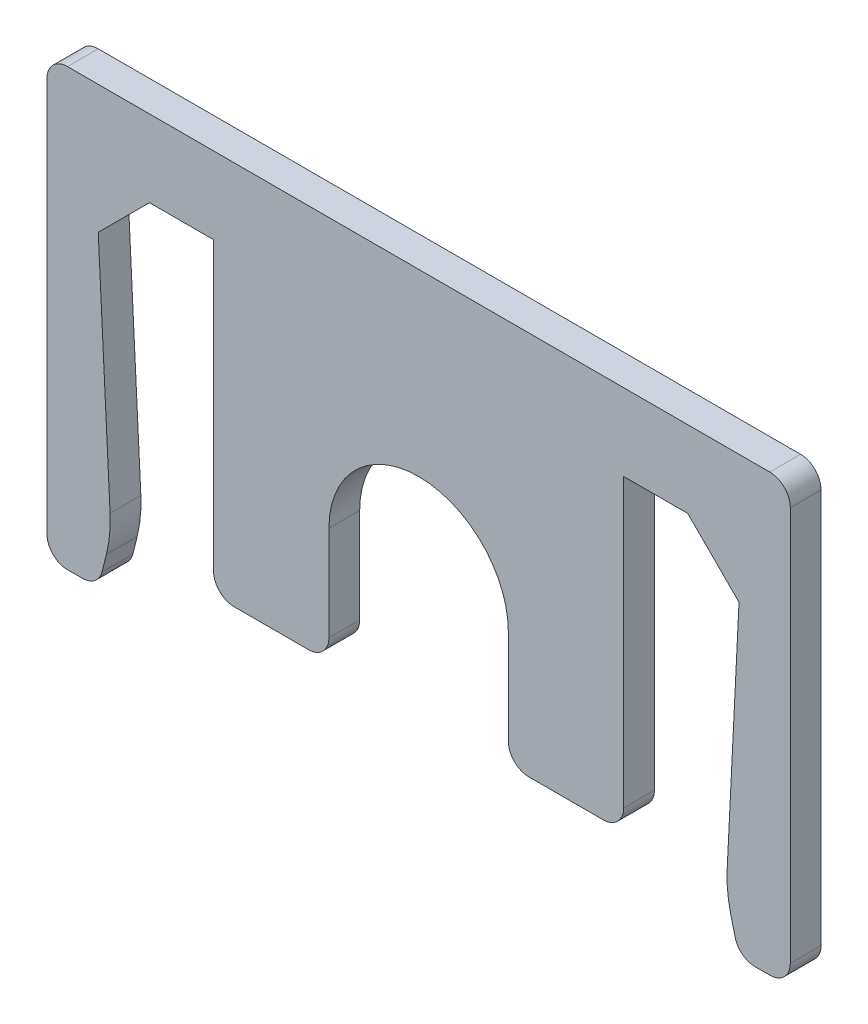
ISO-10303-21;
HEADER;
FILE_DESCRIPTION(('STEP AP214'),'2;1');
FILE_NAME('part.step','',(''),(''),'','','');
FILE_SCHEMA(('AUTOMOTIVE_DESIGN { 1 0 10303 214 1 1 1 1 }'));
ENDSEC;
DATA;
#1=APPLICATION_CONTEXT('core data for automotive mechanical design processes');
#2=APPLICATION_PROTOCOL_DEFINITION('international standard','automotive_design',2000,#1);
#3=PRODUCT_CONTEXT('',#1,'mechanical');
#4=PRODUCT('Part','Part','',(#3));
#5=PRODUCT_RELATED_PRODUCT_CATEGORY('part','',(#4));
#6=PRODUCT_DEFINITION_FORMATION('','',#4);
#7=PRODUCT_DEFINITION_CONTEXT('part definition',#1,'design');
#8=PRODUCT_DEFINITION('design','',#6,#7);
#9=PRODUCT_DEFINITION_SHAPE('','',#8);
#10=(LENGTH_UNIT() NAMED_UNIT(*) SI_UNIT(.MILLI.,.METRE.));
#11=(NAMED_UNIT(*) PLANE_ANGLE_UNIT() SI_UNIT($,.RADIAN.));
#12=(NAMED_UNIT(*) SI_UNIT($,.STERADIAN.) SOLID_ANGLE_UNIT());
#13=UNCERTAINTY_MEASURE_WITH_UNIT(LENGTH_MEASURE(1.E-05),#10,'distance_accuracy_value','');
#14=(GEOMETRIC_REPRESENTATION_CONTEXT(3) GLOBAL_UNCERTAINTY_ASSIGNED_CONTEXT((#13)) GLOBAL_UNIT_ASSIGNED_CONTEXT((#10,
#11,#12)) REPRESENTATION_CONTEXT('',''));
#15=CARTESIAN_POINT('',(0.,0.,0.));
#16=DIRECTION('',(0.,0.,1.));
#17=DIRECTION('',(1.,0.,0.));
#18=AXIS2_PLACEMENT_3D('',#15,#16,#17);
#19=CARTESIAN_POINT('',(-10.5,0.,1.2));
#20=DIRECTION('',(0.,1.,0.));
#21=DIRECTION('',(-1.,0.,0.));
#22=AXIS2_PLACEMENT_3D('',#19,#20,#21);
#23=PLANE('',#22);
#24=DIRECTION('',(1.,0.,0.));
#25=VECTOR('',#24,1.);
#26=CARTESIAN_POINT('',(-10.5,0.,0.));
#27=LINE('',#26,#25);
#28=CARTESIAN_POINT('',(-10.5,0.,0.));
#29=VERTEX_POINT('',#28);
#30=CARTESIAN_POINT('',(-8.,0.,0.));
#31=VERTEX_POINT('',#30);
#32=EDGE_CURVE('E276',#29,#31,#27,.T.);
#33=ORIENTED_EDGE('',*,*,#32,.T.);
#34=DIRECTION('',(0.,0.,-1.));
#35=VECTOR('',#34,1.);
#36=CARTESIAN_POINT('',(-8.,0.,1.2));
#37=LINE('',#36,#35);
#38=CARTESIAN_POINT('',(-8.,0.,1.2));
#39=VERTEX_POINT('',#38);
#40=EDGE_CURVE('E255',#39,#31,#37,.T.);
#41=ORIENTED_EDGE('',*,*,#40,.F.);
#42=DIRECTION('',(1.,0.,0.));
#43=VECTOR('',#42,1.);
#44=CARTESIAN_POINT('',(-10.5,0.,1.2));
#45=LINE('',#44,#43);
#46=CARTESIAN_POINT('',(-10.5,0.,1.2));
#47=VERTEX_POINT('',#46);
#48=EDGE_CURVE('E262',#47,#39,#45,.T.);
#49=ORIENTED_EDGE('',*,*,#48,.F.);
#50=DIRECTION('',(0.,0.,-1.));
#51=VECTOR('',#50,1.);
#52=CARTESIAN_POINT('',(-10.5,0.,1.2));
#53=LINE('',#52,#51);
#54=EDGE_CURVE('E517',#47,#29,#53,.T.);
#55=ORIENTED_EDGE('',*,*,#54,.T.);
#56=EDGE_LOOP('',(#33,#41,#49,#55));
#57=FACE_BOUND('',#56,.T.);
#58=ADVANCED_FACE('F38',(#57),#23,.F.);
#59=CARTESIAN_POINT('',(-8.,-12.,1.2));
#60=DIRECTION('',(1.,0.,0.));
#61=DIRECTION('',(0.,0.,-1.));
#62=AXIS2_PLACEMENT_3D('',#59,#60,#61);
#63=PLANE('',#62);
#64=DIRECTION('',(0.,-1.,0.));
#65=VECTOR('',#64,1.);
#66=CARTESIAN_POINT('',(-8.,-12.,0.));
#67=LINE('',#66,#65);
#68=CARTESIAN_POINT('',(-8.,-11.2,0.));
#69=VERTEX_POINT('',#68);
#70=EDGE_CURVE('E548',#31,#69,#67,.T.);
#71=ORIENTED_EDGE('',*,*,#70,.T.);
#72=DIRECTION('',(0.,0.,-1.));
#73=VECTOR('',#72,1.);
#74=CARTESIAN_POINT('',(-8.,-11.2,1.2));
#75=LINE('',#74,#73);
#76=CARTESIAN_POINT('',(-8.,-11.2,1.2));
#77=VERTEX_POINT('',#76);
#78=EDGE_CURVE('E258',#69,#77,#75,.F.);
#79=ORIENTED_EDGE('',*,*,#78,.T.);
#80=DIRECTION('',(0.,-1.,0.));
#81=VECTOR('',#80,1.);
#82=CARTESIAN_POINT('',(-8.,-12.,1.2));
#83=LINE('',#82,#81);
#84=EDGE_CURVE('E250',#39,#77,#83,.T.);
#85=ORIENTED_EDGE('',*,*,#84,.F.);
#86=ORIENTED_EDGE('',*,*,#40,.T.);
#87=EDGE_LOOP('',(#71,#79,#85,#86));
#88=FACE_BOUND('',#87,.T.);
#89=ADVANCED_FACE('F253',(#88),#63,.F.);
#90=CARTESIAN_POINT('',(-8.,-12.,1.2));
#91=DIRECTION('',(0.,1.,0.));
#92=DIRECTION('',(-1.,0.,0.));
#93=AXIS2_PLACEMENT_3D('',#90,#91,#92);
#94=PLANE('',#93);
#95=DIRECTION('',(1.,0.,0.));
#96=VECTOR('',#95,1.);
#97=CARTESIAN_POINT('',(-8.,-12.,1.2));
#98=LINE('',#97,#96);
#99=CARTESIAN_POINT('',(-7.2,-12.,1.2));
#100=VERTEX_POINT('',#99);
#101=CARTESIAN_POINT('',(-4.3,-12.,1.2));
#102=VERTEX_POINT('',#101);
#103=EDGE_CURVE('E261',#100,#102,#98,.T.);
#104=ORIENTED_EDGE('',*,*,#103,.F.);
#105=DIRECTION('',(0.,0.,-1.));
#106=VECTOR('',#105,1.);
#107=CARTESIAN_POINT('',(-7.2,-12.,1.2));
#108=LINE('',#107,#106);
#109=CARTESIAN_POINT('',(-7.2,-12.,0.));
#110=VERTEX_POINT('',#109);
#111=EDGE_CURVE('E417',#100,#110,#108,.T.);
#112=ORIENTED_EDGE('',*,*,#111,.T.);
#113=DIRECTION('',(1.,0.,0.));
#114=VECTOR('',#113,1.);
#115=CARTESIAN_POINT('',(-8.,-12.,0.));
#116=LINE('',#115,#114);
#117=CARTESIAN_POINT('',(-4.3,-12.,0.));
#118=VERTEX_POINT('',#117);
#119=EDGE_CURVE('E542',#110,#118,#116,.T.);
#120=ORIENTED_EDGE('',*,*,#119,.T.);
#121=DIRECTION('',(0.,0.,-1.));
#122=VECTOR('',#121,1.);
#123=CARTESIAN_POINT('',(-4.3,-12.,1.2));
#124=LINE('',#123,#122);
#125=EDGE_CURVE('E414',#118,#102,#124,.F.);
#126=ORIENTED_EDGE('',*,*,#125,.T.);
#127=EDGE_LOOP('',(#104,#112,#120,#126));
#128=FACE_BOUND('',#127,.T.);
#129=ADVANCED_FACE('F625',(#128),#94,.F.);
#130=CARTESIAN_POINT('',(-3.5,-7.5,1.2));
#131=DIRECTION('',(-1.,0.,0.));
#132=DIRECTION('',(0.,-1.,0.));
#133=AXIS2_PLACEMENT_3D('',#130,#131,#132);
#134=PLANE('',#133);
#135=DIRECTION('',(0.,1.,0.));
#136=VECTOR('',#135,1.);
#137=CARTESIAN_POINT('',(-3.5,-7.5,1.2));
#138=LINE('',#137,#136);
#139=CARTESIAN_POINT('',(-3.5,-11.2,1.2));
#140=VERTEX_POINT('',#139);
#141=CARTESIAN_POINT('',(-3.5,-7.5,1.2));
#142=VERTEX_POINT('',#141);
#143=EDGE_CURVE('E599',#140,#142,#138,.T.);
#144=ORIENTED_EDGE('',*,*,#143,.F.);
#145=DIRECTION('',(0.,0.,-1.));
#146=VECTOR('',#145,1.);
#147=CARTESIAN_POINT('',(-3.5,-11.2,1.2));
#148=LINE('',#147,#146);
#149=CARTESIAN_POINT('',(-3.5,-11.2,0.));
#150=VERTEX_POINT('',#149);
#151=EDGE_CURVE('E11',#140,#150,#148,.T.);
#152=ORIENTED_EDGE('',*,*,#151,.T.);
#153=DIRECTION('',(0.,1.,0.));
#154=VECTOR('',#153,1.);
#155=CARTESIAN_POINT('',(-3.5,-7.5,0.));
#156=LINE('',#155,#154);
#157=CARTESIAN_POINT('',(-3.5,-7.5,0.));
#158=VERTEX_POINT('',#157);
#159=EDGE_CURVE('E539',#150,#158,#156,.T.);
#160=ORIENTED_EDGE('',*,*,#159,.T.);
#161=DIRECTION('',(0.,0.,-1.));
#162=VECTOR('',#161,1.);
#163=CARTESIAN_POINT('',(-3.5,-7.5,1.2));
#164=LINE('',#163,#162);
#165=EDGE_CURVE('E279',#142,#158,#164,.T.);
#166=ORIENTED_EDGE('',*,*,#165,.F.);
#167=EDGE_LOOP('',(#144,#152,#160,#166));
#168=FACE_BOUND('',#167,.T.);
#169=ADVANCED_FACE('F613',(#168),#134,.F.);
#170=CARTESIAN_POINT('',(0.,-7.5,1.2));
#171=DIRECTION('',(0.,0.,-1.));
#172=DIRECTION('',(-1.,0.,0.));
#173=AXIS2_PLACEMENT_3D('',#170,#171,#172);
#174=CYLINDRICAL_SURFACE('',#173,3.5);
#175=CARTESIAN_POINT('',(0.,-7.5,0.));
#176=DIRECTION('',(0.,0.,-1.));
#177=DIRECTION('',(1.,0.,0.));
#178=AXIS2_PLACEMENT_3D('',#175,#176,#177);
#179=CIRCLE('',#178,3.5);
#180=CARTESIAN_POINT('',(3.5,-7.5,0.));
#181=VERTEX_POINT('',#180);
#182=EDGE_CURVE('E473',#158,#181,#179,.T.);
#183=ORIENTED_EDGE('',*,*,#182,.T.);
#184=DIRECTION('',(0.,0.,-1.));
#185=VECTOR('',#184,1.);
#186=CARTESIAN_POINT('',(3.5,-7.5,1.2));
#187=LINE('',#186,#185);
#188=CARTESIAN_POINT('',(3.5,-7.5,1.2));
#189=VERTEX_POINT('',#188);
#190=EDGE_CURVE('E287',#189,#181,#187,.T.);
#191=ORIENTED_EDGE('',*,*,#190,.F.);
#192=CARTESIAN_POINT('',(0.,-7.5,1.2));
#193=DIRECTION('',(0.,0.,-1.));
#194=DIRECTION('',(1.,0.,0.));
#195=AXIS2_PLACEMENT_3D('',#192,#193,#194);
#196=CIRCLE('',#195,3.5);
#197=EDGE_CURVE('E449',#142,#189,#196,.T.);
#198=ORIENTED_EDGE('',*,*,#197,.F.);
#199=ORIENTED_EDGE('',*,*,#165,.T.);
#200=EDGE_LOOP('',(#183,#191,#198,#199));
#201=FACE_BOUND('',#200,.T.);
#202=ADVANCED_FACE('F615',(#201),#174,.F.);
#203=CARTESIAN_POINT('',(3.5,-7.5,1.2));
#204=DIRECTION('',(1.,0.,0.));
#205=DIRECTION('',(0.,1.,0.));
#206=AXIS2_PLACEMENT_3D('',#203,#204,#205);
#207=PLANE('',#206);
#208=DIRECTION('',(0.,-1.,0.));
#209=VECTOR('',#208,1.);
#210=CARTESIAN_POINT('',(3.5,-7.5,0.));
#211=LINE('',#210,#209);
#212=CARTESIAN_POINT('',(3.5,-11.2,0.));
#213=VERTEX_POINT('',#212);
#214=EDGE_CURVE('E443',#181,#213,#211,.T.);
#215=ORIENTED_EDGE('',*,*,#214,.T.);
#216=DIRECTION('',(0.,0.,-1.));
#217=VECTOR('',#216,1.);
#218=CARTESIAN_POINT('',(3.5,-11.2,1.2));
#219=LINE('',#218,#217);
#220=CARTESIAN_POINT('',(3.5,-11.2,1.2));
#221=VERTEX_POINT('',#220);
#222=EDGE_CURVE('E47',#213,#221,#219,.F.);
#223=ORIENTED_EDGE('',*,*,#222,.T.);
#224=DIRECTION('',(0.,-1.,0.));
#225=VECTOR('',#224,1.);
#226=CARTESIAN_POINT('',(3.5,-7.5,1.2));
#227=LINE('',#226,#225);
#228=EDGE_CURVE('E441',#189,#221,#227,.T.);
#229=ORIENTED_EDGE('',*,*,#228,.F.);
#230=ORIENTED_EDGE('',*,*,#190,.T.);
#231=EDGE_LOOP('',(#215,#223,#229,#230));
#232=FACE_BOUND('',#231,.T.);
#233=ADVANCED_FACE('F439',(#232),#207,.F.);
#234=CARTESIAN_POINT('',(3.5,-12.,1.2));
#235=DIRECTION('',(0.,1.,0.));
#236=DIRECTION('',(-1.,0.,0.));
#237=AXIS2_PLACEMENT_3D('',#234,#235,#236);
#238=PLANE('',#237);
#239=DIRECTION('',(1.,0.,0.));
#240=VECTOR('',#239,1.);
#241=CARTESIAN_POINT('',(3.5,-12.,0.));
#242=LINE('',#241,#240);
#243=CARTESIAN_POINT('',(4.3,-12.,0.));
#244=VERTEX_POINT('',#243);
#245=CARTESIAN_POINT('',(7.2,-12.,0.));
#246=VERTEX_POINT('',#245);
#247=EDGE_CURVE('E460',#244,#246,#242,.T.);
#248=ORIENTED_EDGE('',*,*,#247,.T.);
#249=DIRECTION('',(0.,0.,-1.));
#250=VECTOR('',#249,1.);
#251=CARTESIAN_POINT('',(7.2,-12.,1.2));
#252=LINE('',#251,#250);
#253=CARTESIAN_POINT('',(7.2,-12.,1.2));
#254=VERTEX_POINT('',#253);
#255=EDGE_CURVE('E431',#246,#254,#252,.F.);
#256=ORIENTED_EDGE('',*,*,#255,.T.);
#257=DIRECTION('',(1.,0.,0.));
#258=VECTOR('',#257,1.);
#259=CARTESIAN_POINT('',(3.5,-12.,1.2));
#260=LINE('',#259,#258);
#261=CARTESIAN_POINT('',(4.3,-12.,1.2));
#262=VERTEX_POINT('',#261);
#263=EDGE_CURVE('E452',#262,#254,#260,.T.);
#264=ORIENTED_EDGE('',*,*,#263,.F.);
#265=DIRECTION('',(0.,0.,-1.));
#266=VECTOR('',#265,1.);
#267=CARTESIAN_POINT('',(4.3,-12.,1.2));
#268=LINE('',#267,#266);
#269=EDGE_CURVE('E427',#262,#244,#268,.T.);
#270=ORIENTED_EDGE('',*,*,#269,.T.);
#271=EDGE_LOOP('',(#248,#256,#264,#270));
#272=FACE_BOUND('',#271,.T.);
#273=ADVANCED_FACE('F459',(#272),#238,.F.);
#274=CARTESIAN_POINT('',(8.,-12.,1.2));
#275=DIRECTION('',(-1.,0.,0.));
#276=DIRECTION('',(0.,0.,1.));
#277=AXIS2_PLACEMENT_3D('',#274,#275,#276);
#278=PLANE('',#277);
#279=DIRECTION('',(0.,1.,0.));
#280=VECTOR('',#279,1.);
#281=CARTESIAN_POINT('',(8.,-12.,1.2));
#282=LINE('',#281,#280);
#283=CARTESIAN_POINT('',(8.,-11.2,1.2));
#284=VERTEX_POINT('',#283);
#285=CARTESIAN_POINT('',(8.,0.,1.2));
#286=VERTEX_POINT('',#285);
#287=EDGE_CURVE('E592',#284,#286,#282,.T.);
#288=ORIENTED_EDGE('',*,*,#287,.F.);
#289=DIRECTION('',(0.,0.,-1.));
#290=VECTOR('',#289,1.);
#291=CARTESIAN_POINT('',(8.,-11.2,1.2));
#292=LINE('',#291,#290);
#293=CARTESIAN_POINT('',(8.,-11.2,0.));
#294=VERTEX_POINT('',#293);
#295=EDGE_CURVE('E423',#284,#294,#292,.T.);
#296=ORIENTED_EDGE('',*,*,#295,.T.);
#297=DIRECTION('',(0.,1.,0.));
#298=VECTOR('',#297,1.);
#299=CARTESIAN_POINT('',(8.,-12.,0.));
#300=LINE('',#299,#298);
#301=CARTESIAN_POINT('',(8.,0.,0.));
#302=VERTEX_POINT('',#301);
#303=EDGE_CURVE('E467',#294,#302,#300,.T.);
#304=ORIENTED_EDGE('',*,*,#303,.T.);
#305=DIRECTION('',(0.,0.,-1.));
#306=VECTOR('',#305,1.);
#307=CARTESIAN_POINT('',(8.,0.,1.2));
#308=LINE('',#307,#306);
#309=EDGE_CURVE('E532',#286,#302,#308,.T.);
#310=ORIENTED_EDGE('',*,*,#309,.F.);
#311=EDGE_LOOP('',(#288,#296,#304,#310));
#312=FACE_BOUND('',#311,.T.);
#313=ADVANCED_FACE('F812',(#312),#278,.F.);
#314=CARTESIAN_POINT('',(8.,0.,1.2));
#315=DIRECTION('',(0.,1.,0.));
#316=DIRECTION('',(-1.,0.,0.));
#317=AXIS2_PLACEMENT_3D('',#314,#315,#316);
#318=PLANE('',#317);
#319=DIRECTION('',(1.,0.,0.));
#320=VECTOR('',#319,1.);
#321=CARTESIAN_POINT('',(8.,0.,0.));
#322=LINE('',#321,#320);
#323=CARTESIAN_POINT('',(10.5,0.,0.));
#324=VERTEX_POINT('',#323);
#325=EDGE_CURVE('E471',#302,#324,#322,.T.);
#326=ORIENTED_EDGE('',*,*,#325,.T.);
#327=DIRECTION('',(0.,0.,-1.));
#328=VECTOR('',#327,1.);
#329=CARTESIAN_POINT('',(10.5,0.,1.2));
#330=LINE('',#329,#328);
#331=CARTESIAN_POINT('',(10.5,0.,1.2));
#332=VERTEX_POINT('',#331);
#333=EDGE_CURVE('E528',#332,#324,#330,.T.);
#334=ORIENTED_EDGE('',*,*,#333,.F.);
#335=DIRECTION('',(1.,0.,0.));
#336=VECTOR('',#335,1.);
#337=CARTESIAN_POINT('',(8.,0.,1.2));
#338=LINE('',#337,#336);
#339=EDGE_CURVE('E589',#286,#332,#338,.T.);
#340=ORIENTED_EDGE('',*,*,#339,.F.);
#341=ORIENTED_EDGE('',*,*,#309,.T.);
#342=EDGE_LOOP('',(#326,#334,#340,#341));
#343=FACE_BOUND('',#342,.T.);
#344=ADVANCED_FACE('F816',(#343),#318,.F.);
#345=CARTESIAN_POINT('',(12.5,-2.,1.2));
#346=DIRECTION('',(0.707106781186547,0.707106781186548,0.));
#347=DIRECTION('',(-0.707106781186548,0.707106781186547,0.));
#348=AXIS2_PLACEMENT_3D('',#345,#346,#347);
#349=PLANE('',#348);
#350=DIRECTION('',(0.707106781186548,-0.707106781186547,0.));
#351=VECTOR('',#350,1.);
#352=CARTESIAN_POINT('',(12.5,-2.,0.));
#353=LINE('',#352,#351);
#354=CARTESIAN_POINT('',(12.5,-2.,0.));
#355=VERTEX_POINT('',#354);
#356=EDGE_CURVE('E479',#324,#355,#353,.T.);
#357=ORIENTED_EDGE('',*,*,#356,.T.);
#358=DIRECTION('',(0.,0.,-1.));
#359=VECTOR('',#358,1.);
#360=CARTESIAN_POINT('',(12.5,-2.,1.2));
#361=LINE('',#360,#359);
#362=CARTESIAN_POINT('',(12.5,-2.,1.2));
#363=VERTEX_POINT('',#362);
#364=EDGE_CURVE('E524',#363,#355,#361,.T.);
#365=ORIENTED_EDGE('',*,*,#364,.F.);
#366=DIRECTION('',(0.707106781186548,-0.707106781186547,0.));
#367=VECTOR('',#366,1.);
#368=CARTESIAN_POINT('',(12.5,-2.,1.2));
#369=LINE('',#368,#367);
#370=EDGE_CURVE('E586',#332,#363,#369,.T.);
#371=ORIENTED_EDGE('',*,*,#370,.F.);
#372=ORIENTED_EDGE('',*,*,#333,.T.);
#373=EDGE_LOOP('',(#357,#365,#371,#372));
#374=FACE_BOUND('',#373,.T.);
#375=ADVANCED_FACE('F861',(#374),#349,.F.);
#376=CARTESIAN_POINT('',(12.,-12.,1.2));
#377=DIRECTION('',(0.998752338877844,-0.0499376169438947,0.));
#378=DIRECTION('',(0.0499376169438947,0.998752338877845,0.));
#379=AXIS2_PLACEMENT_3D('',#376,#377,#378);
#380=PLANE('',#379);
#381=DIRECTION('',(-0.0499376169438947,-0.998752338877845,0.));
#382=VECTOR('',#381,1.);
#383=CARTESIAN_POINT('',(12.,-12.,0.));
#384=LINE('',#383,#382);
#385=CARTESIAN_POINT('',(12.0370903931354,-11.2581921372909,0.));
#386=VERTEX_POINT('',#385);
#387=EDGE_CURVE('E482',#355,#386,#384,.T.);
#388=ORIENTED_EDGE('',*,*,#387,.T.);
#389=DIRECTION('',(0.,0.,-1.));
#390=VECTOR('',#389,1.);
#391=CARTESIAN_POINT('',(12.0370903931354,-11.2581921372909,1.2));
#392=LINE('',#391,#390);
#393=CARTESIAN_POINT('',(12.0370903931354,-11.2581921372909,1.2));
#394=VERTEX_POINT('',#393);
#395=EDGE_CURVE('E311',#386,#394,#392,.F.);
#396=ORIENTED_EDGE('',*,*,#395,.T.);
#397=DIRECTION('',(-0.0499376169438947,-0.998752338877845,0.));
#398=VECTOR('',#397,1.);
#399=CARTESIAN_POINT('',(12.,-12.,1.2));
#400=LINE('',#399,#398);
#401=EDGE_CURVE('E582',#363,#394,#400,.T.);
#402=ORIENTED_EDGE('',*,*,#401,.F.);
#403=ORIENTED_EDGE('',*,*,#364,.T.);
#404=EDGE_LOOP('',(#388,#396,#402,#403));
#405=FACE_BOUND('',#404,.T.);
#406=ADVANCED_FACE('F806',(#405),#380,.F.);
#407=CARTESIAN_POINT('',(12.5,-14.,1.2));
#408=DIRECTION('',(0.970142500145332,0.242535625036332,0.));
#409=DIRECTION('',(-0.242535625036332,0.970142500145332,0.));
#410=AXIS2_PLACEMENT_3D('',#407,#408,#409);
#411=PLANE('',#410);
#412=DIRECTION('',(0.242535625036332,-0.970142500145332,0.));
#413=VECTOR('',#412,1.);
#414=CARTESIAN_POINT('',(12.5,-14.,0.));
#415=LINE('',#414,#413);
#416=CARTESIAN_POINT('',(12.180139586798,-12.7205583471921,0.));
#417=VERTEX_POINT('',#416);
#418=CARTESIAN_POINT('',(12.3485071250072,-13.3940285000291,0.));
#419=VERTEX_POINT('',#418);
#420=EDGE_CURVE('E486',#417,#419,#415,.T.);
#421=ORIENTED_EDGE('',*,*,#420,.T.);
#422=DIRECTION('',(0.,0.,-1.));
#423=VECTOR('',#422,1.);
#424=CARTESIAN_POINT('',(12.3485071250072,-13.3940285000291,1.2));
#425=LINE('',#424,#423);
#426=CARTESIAN_POINT('',(12.3485071250072,-13.3940285000291,1.2));
#427=VERTEX_POINT('',#426);
#428=EDGE_CURVE('E407',#419,#427,#425,.F.);
#429=ORIENTED_EDGE('',*,*,#428,.T.);
#430=DIRECTION('',(0.242535625036332,-0.970142500145332,0.));
#431=VECTOR('',#430,1.);
#432=CARTESIAN_POINT('',(12.5,-14.,1.2));
#433=LINE('',#432,#431);
#434=CARTESIAN_POINT('',(12.180139586798,-12.7205583471921,1.2));
#435=VERTEX_POINT('',#434);
#436=EDGE_CURVE('E578',#435,#427,#433,.T.);
#437=ORIENTED_EDGE('',*,*,#436,.F.);
#438=DIRECTION('',(0.,0.,-1.));
#439=VECTOR('',#438,1.);
#440=CARTESIAN_POINT('',(12.180139586798,-12.7205583471921,1.2));
#441=LINE('',#440,#439);
#442=EDGE_CURVE('E307',#435,#417,#441,.T.);
#443=ORIENTED_EDGE('',*,*,#442,.T.);
#444=EDGE_LOOP('',(#421,#429,#437,#443));
#445=FACE_BOUND('',#444,.T.);
#446=ADVANCED_FACE('F798',(#445),#411,.F.);
#447=CARTESIAN_POINT('',(12.5,-14.,1.2));
#448=DIRECTION('',(0.,1.,0.));
#449=DIRECTION('',(0.,0.,1.));
#450=AXIS2_PLACEMENT_3D('',#447,#448,#449);
#451=PLANE('',#450);
#452=DIRECTION('',(1.,0.,0.));
#453=VECTOR('',#452,1.);
#454=CARTESIAN_POINT('',(12.5,-14.,0.));
#455=LINE('',#454,#453);
#456=CARTESIAN_POINT('',(13.1246211251235,-14.,0.));
#457=VERTEX_POINT('',#456);
#458=CARTESIAN_POINT('',(13.7,-14.,0.));
#459=VERTEX_POINT('',#458);
#460=EDGE_CURVE('E490',#457,#459,#455,.T.);
#461=ORIENTED_EDGE('',*,*,#460,.T.);
#462=DIRECTION('',(0.,0.,-1.));
#463=VECTOR('',#462,1.);
#464=CARTESIAN_POINT('',(13.7,-14.,1.2));
#465=LINE('',#464,#463);
#466=CARTESIAN_POINT('',(13.7,-14.,1.2));
#467=VERTEX_POINT('',#466);
#468=EDGE_CURVE('E398',#459,#467,#465,.F.);
#469=ORIENTED_EDGE('',*,*,#468,.T.);
#470=DIRECTION('',(1.,0.,0.));
#471=VECTOR('',#470,1.);
#472=CARTESIAN_POINT('',(12.5,-14.,1.2));
#473=LINE('',#472,#471);
#474=CARTESIAN_POINT('',(13.1246211251235,-14.,1.2));
#475=VERTEX_POINT('',#474);
#476=EDGE_CURVE('E574',#475,#467,#473,.T.);
#477=ORIENTED_EDGE('',*,*,#476,.F.);
#478=DIRECTION('',(0.,0.,-1.));
#479=VECTOR('',#478,1.);
#480=CARTESIAN_POINT('',(13.1246211251235,-14.,1.2));
#481=LINE('',#480,#479);
#482=EDGE_CURVE('E394',#475,#457,#481,.T.);
#483=ORIENTED_EDGE('',*,*,#482,.T.);
#484=EDGE_LOOP('',(#461,#469,#477,#483));
#485=FACE_BOUND('',#484,.T.);
#486=ADVANCED_FACE('F790',(#485),#451,.F.);
#487=CARTESIAN_POINT('',(14.5,-14.,1.2));
#488=DIRECTION('',(-1.,0.,0.));
#489=DIRECTION('',(0.,0.,1.));
#490=AXIS2_PLACEMENT_3D('',#487,#488,#489);
#491=PLANE('',#490);
#492=DIRECTION('',(0.,1.,0.));
#493=VECTOR('',#492,1.);
#494=CARTESIAN_POINT('',(14.5,-14.,0.));
#495=LINE('',#494,#493);
#496=CARTESIAN_POINT('',(14.5,-13.2,0.));
#497=VERTEX_POINT('',#496);
#498=CARTESIAN_POINT('',(14.5,2.2,0.));
#499=VERTEX_POINT('',#498);
#500=EDGE_CURVE('E494',#497,#499,#495,.T.);
#501=ORIENTED_EDGE('',*,*,#500,.T.);
#502=DIRECTION('',(0.,0.,-1.));
#503=VECTOR('',#502,1.);
#504=CARTESIAN_POINT('',(14.5,2.2,1.2));
#505=LINE('',#504,#503);
#506=CARTESIAN_POINT('',(14.5,2.2,1.2));
#507=VERTEX_POINT('',#506);
#508=EDGE_CURVE('E355',#499,#507,#505,.F.);
#509=ORIENTED_EDGE('',*,*,#508,.T.);
#510=DIRECTION('',(0.,1.,0.));
#511=VECTOR('',#510,1.);
#512=CARTESIAN_POINT('',(14.5,-14.,1.2));
#513=LINE('',#512,#511);
#514=CARTESIAN_POINT('',(14.5,-13.2,1.2));
#515=VERTEX_POINT('',#514);
#516=EDGE_CURVE('E571',#515,#507,#513,.T.);
#517=ORIENTED_EDGE('',*,*,#516,.F.);
#518=DIRECTION('',(0.,0.,-1.));
#519=VECTOR('',#518,1.);
#520=CARTESIAN_POINT('',(14.5,-13.2,1.2));
#521=LINE('',#520,#519);
#522=EDGE_CURVE('E351',#515,#497,#521,.T.);
#523=ORIENTED_EDGE('',*,*,#522,.T.);
#524=EDGE_LOOP('',(#501,#509,#517,#523));
#525=FACE_BOUND('',#524,.T.);
#526=ADVANCED_FACE('F782',(#525),#491,.F.);
#527=CARTESIAN_POINT('',(-12.5,3.,1.2));
#528=DIRECTION('',(0.,-1.,0.));
#529=DIRECTION('',(1.,0.,0.));
#530=AXIS2_PLACEMENT_3D('',#527,#528,#529);
#531=PLANE('',#530);
#532=DIRECTION('',(-1.,0.,0.));
#533=VECTOR('',#532,1.);
#534=CARTESIAN_POINT('',(12.5,3.,1.2));
#535=LINE('',#534,#533);
#536=CARTESIAN_POINT('',(13.7,3.,1.2));
#537=VERTEX_POINT('',#536);
#538=CARTESIAN_POINT('',(-13.7,3.,1.2));
#539=VERTEX_POINT('',#538);
#540=EDGE_CURVE('E567',#537,#539,#535,.T.);
#541=ORIENTED_EDGE('',*,*,#540,.F.);
#542=DIRECTION('',(0.,0.,-1.));
#543=VECTOR('',#542,1.);
#544=CARTESIAN_POINT('',(13.7,3.,1.2));
#545=LINE('',#544,#543);
#546=CARTESIAN_POINT('',(13.7,3.,0.));
#547=VERTEX_POINT('',#546);
#548=EDGE_CURVE('E317',#537,#547,#545,.T.);
#549=ORIENTED_EDGE('',*,*,#548,.T.);
#550=DIRECTION('',(-1.,0.,0.));
#551=VECTOR('',#550,1.);
#552=CARTESIAN_POINT('',(-12.5,3.,0.));
#553=LINE('',#552,#551);
#554=CARTESIAN_POINT('',(-13.7,3.,0.));
#555=VERTEX_POINT('',#554);
#556=EDGE_CURVE('E498',#547,#555,#553,.T.);
#557=ORIENTED_EDGE('',*,*,#556,.T.);
#558=DIRECTION('',(0.,0.,-1.));
#559=VECTOR('',#558,1.);
#560=CARTESIAN_POINT('',(-13.7,3.,1.2));
#561=LINE('',#560,#559);
#562=EDGE_CURVE('E314',#555,#539,#561,.F.);
#563=ORIENTED_EDGE('',*,*,#562,.T.);
#564=EDGE_LOOP('',(#541,#549,#557,#563));
#565=FACE_BOUND('',#564,.T.);
#566=ADVANCED_FACE('F774',(#565),#531,.F.);
#567=CARTESIAN_POINT('',(-14.5,-14.,1.2));
#568=DIRECTION('',(1.,0.,0.));
#569=DIRECTION('',(0.,0.,-1.));
#570=AXIS2_PLACEMENT_3D('',#567,#568,#569);
#571=PLANE('',#570);
#572=DIRECTION('',(0.,-1.,0.));
#573=VECTOR('',#572,1.);
#574=CARTESIAN_POINT('',(-14.5,-14.,1.2));
#575=LINE('',#574,#573);
#576=CARTESIAN_POINT('',(-14.5,2.2,1.2));
#577=VERTEX_POINT('',#576);
#578=CARTESIAN_POINT('',(-14.5,-13.2,1.2));
#579=VERTEX_POINT('',#578);
#580=EDGE_CURVE('E564',#577,#579,#575,.T.);
#581=ORIENTED_EDGE('',*,*,#580,.F.);
#582=DIRECTION('',(0.,0.,-1.));
#583=VECTOR('',#582,1.);
#584=CARTESIAN_POINT('',(-14.5,2.2,1.2));
#585=LINE('',#584,#583);
#586=CARTESIAN_POINT('',(-14.5,2.2,0.));
#587=VERTEX_POINT('',#586);
#588=EDGE_CURVE('E390',#577,#587,#585,.T.);
#589=ORIENTED_EDGE('',*,*,#588,.T.);
#590=DIRECTION('',(0.,-1.,0.));
#591=VECTOR('',#590,1.);
#592=CARTESIAN_POINT('',(-14.5,-14.,0.));
#593=LINE('',#592,#591);
#594=CARTESIAN_POINT('',(-14.5,-13.2,0.));
#595=VERTEX_POINT('',#594);
#596=EDGE_CURVE('E502',#587,#595,#593,.T.);
#597=ORIENTED_EDGE('',*,*,#596,.T.);
#598=DIRECTION('',(0.,0.,-1.));
#599=VECTOR('',#598,1.);
#600=CARTESIAN_POINT('',(-14.5,-13.2,1.2));
#601=LINE('',#600,#599);
#602=EDGE_CURVE('E387',#595,#579,#601,.F.);
#603=ORIENTED_EDGE('',*,*,#602,.T.);
#604=EDGE_LOOP('',(#581,#589,#597,#603));
#605=FACE_BOUND('',#604,.T.);
#606=ADVANCED_FACE('F767',(#605),#571,.F.);
#607=CARTESIAN_POINT('',(-12.5,-14.,1.2));
#608=DIRECTION('',(0.,1.,0.));
#609=DIRECTION('',(0.,0.,1.));
#610=AXIS2_PLACEMENT_3D('',#607,#608,#609);
#611=PLANE('',#610);
#612=DIRECTION('',(1.,0.,0.));
#613=VECTOR('',#612,1.);
#614=CARTESIAN_POINT('',(-12.5,-14.,1.2));
#615=LINE('',#614,#613);
#616=CARTESIAN_POINT('',(-13.7,-14.,1.2));
#617=VERTEX_POINT('',#616);
#618=CARTESIAN_POINT('',(-13.1246211251235,-14.,1.2));
#619=VERTEX_POINT('',#618);
#620=EDGE_CURVE('E561',#617,#619,#615,.T.);
#621=ORIENTED_EDGE('',*,*,#620,.F.);
#622=DIRECTION('',(0.,0.,-1.));
#623=VECTOR('',#622,1.);
#624=CARTESIAN_POINT('',(-13.7,-14.,1.2));
#625=LINE('',#624,#623);
#626=CARTESIAN_POINT('',(-13.7,-14.,0.));
#627=VERTEX_POINT('',#626);
#628=EDGE_CURVE('E403',#617,#627,#625,.T.);
#629=ORIENTED_EDGE('',*,*,#628,.T.);
#630=DIRECTION('',(1.,0.,0.));
#631=VECTOR('',#630,1.);
#632=CARTESIAN_POINT('',(-12.5,-14.,0.));
#633=LINE('',#632,#631);
#634=CARTESIAN_POINT('',(-13.1246211251235,-14.,0.));
#635=VERTEX_POINT('',#634);
#636=EDGE_CURVE('E506',#627,#635,#633,.T.);
#637=ORIENTED_EDGE('',*,*,#636,.T.);
#638=DIRECTION('',(0.,0.,-1.));
#639=VECTOR('',#638,1.);
#640=CARTESIAN_POINT('',(-13.1246211251235,-14.,1.2));
#641=LINE('',#640,#639);
#642=EDGE_CURVE('E54',#635,#619,#641,.F.);
#643=ORIENTED_EDGE('',*,*,#642,.T.);
#644=EDGE_LOOP('',(#621,#629,#637,#643));
#645=FACE_BOUND('',#644,.T.);
#646=ADVANCED_FACE('F758',(#645),#611,.F.);
#647=CARTESIAN_POINT('',(-12.,-12.,1.2));
#648=DIRECTION('',(-0.970142500145332,0.242535625036333,0.));
#649=DIRECTION('',(-0.242535625036333,-0.970142500145332,0.));
#650=AXIS2_PLACEMENT_3D('',#647,#648,#649);
#651=PLANE('',#650);
#652=DIRECTION('',(0.242535625036333,0.970142500145332,0.));
#653=VECTOR('',#652,1.);
#654=CARTESIAN_POINT('',(-12.,-12.,1.2));
#655=LINE('',#654,#653);
#656=CARTESIAN_POINT('',(-12.3485071250073,-13.3940285000291,1.2));
#657=VERTEX_POINT('',#656);
#658=CARTESIAN_POINT('',(-12.180139586798,-12.7205583471921,1.2));
#659=VERTEX_POINT('',#658);
#660=EDGE_CURVE('E558',#657,#659,#655,.T.);
#661=ORIENTED_EDGE('',*,*,#660,.F.);
#662=DIRECTION('',(0.,0.,-1.));
#663=VECTOR('',#662,1.);
#664=CARTESIAN_POINT('',(-12.3485071250073,-13.3940285000291,1.2));
#665=LINE('',#664,#663);
#666=CARTESIAN_POINT('',(-12.3485071250073,-13.3940285000291,0.));
#667=VERTEX_POINT('',#666);
#668=EDGE_CURVE('E410',#657,#667,#665,.T.);
#669=ORIENTED_EDGE('',*,*,#668,.T.);
#670=DIRECTION('',(0.242535625036333,0.970142500145332,0.));
#671=VECTOR('',#670,1.);
#672=CARTESIAN_POINT('',(-12.,-12.,0.));
#673=LINE('',#672,#671);
#674=CARTESIAN_POINT('',(-12.180139586798,-12.7205583471921,0.));
#675=VERTEX_POINT('',#674);
#676=EDGE_CURVE('E509',#667,#675,#673,.T.);
#677=ORIENTED_EDGE('',*,*,#676,.T.);
#678=DIRECTION('',(0.,0.,-1.));
#679=VECTOR('',#678,1.);
#680=CARTESIAN_POINT('',(-12.180139586798,-12.7205583471921,1.2));
#681=LINE('',#680,#679);
#682=EDGE_CURVE('E297',#675,#659,#681,.F.);
#683=ORIENTED_EDGE('',*,*,#682,.T.);
#684=EDGE_LOOP('',(#661,#669,#677,#683));
#685=FACE_BOUND('',#684,.T.);
#686=ADVANCED_FACE('F753',(#685),#651,.F.);
#687=CARTESIAN_POINT('',(-12.5,-2.,1.2));
#688=DIRECTION('',(-0.998752338877845,-0.0499376169438921,0.));
#689=DIRECTION('',(0.0499376169438921,-0.998752338877845,0.));
#690=AXIS2_PLACEMENT_3D('',#687,#688,#689);
#691=PLANE('',#690);
#692=DIRECTION('',(-0.0499376169438921,0.998752338877845,0.));
#693=VECTOR('',#692,1.);
#694=CARTESIAN_POINT('',(-12.5,-2.,1.2));
#695=LINE('',#694,#693);
#696=CARTESIAN_POINT('',(-12.0370903931355,-11.2581921372909,1.2));
#697=VERTEX_POINT('',#696);
#698=CARTESIAN_POINT('',(-12.5,-2.,1.2));
#699=VERTEX_POINT('',#698);
#700=EDGE_CURVE('E555',#697,#699,#695,.T.);
#701=ORIENTED_EDGE('',*,*,#700,.F.);
#702=DIRECTION('',(0.,0.,-1.));
#703=VECTOR('',#702,1.);
#704=CARTESIAN_POINT('',(-12.0370903931355,-11.2581921372909,1.2));
#705=LINE('',#704,#703);
#706=CARTESIAN_POINT('',(-12.0370903931355,-11.2581921372909,0.));
#707=VERTEX_POINT('',#706);
#708=EDGE_CURVE('E278',#697,#707,#705,.T.);
#709=ORIENTED_EDGE('',*,*,#708,.T.);
#710=DIRECTION('',(-0.0499376169438921,0.998752338877845,0.));
#711=VECTOR('',#710,1.);
#712=CARTESIAN_POINT('',(-12.5,-2.,0.));
#713=LINE('',#712,#711);
#714=CARTESIAN_POINT('',(-12.5,-2.,0.));
#715=VERTEX_POINT('',#714);
#716=EDGE_CURVE('E512',#707,#715,#713,.T.);
#717=ORIENTED_EDGE('',*,*,#716,.T.);
#718=DIRECTION('',(0.,0.,-1.));
#719=VECTOR('',#718,1.);
#720=CARTESIAN_POINT('',(-12.5,-2.,1.2));
#721=LINE('',#720,#719);
#722=EDGE_CURVE('E520',#699,#715,#721,.T.);
#723=ORIENTED_EDGE('',*,*,#722,.F.);
#724=EDGE_LOOP('',(#701,#709,#717,#723));
#725=FACE_BOUND('',#724,.T.);
#726=ADVANCED_FACE('F757',(#725),#691,.F.);
#727=CARTESIAN_POINT('',(-10.5,0.,1.2));
#728=DIRECTION('',(-0.707106781186547,0.707106781186548,0.));
#729=DIRECTION('',(-0.707106781186548,-0.707106781186547,0.));
#730=AXIS2_PLACEMENT_3D('',#727,#728,#729);
#731=PLANE('',#730);
#732=DIRECTION('',(0.707106781186548,0.707106781186547,0.));
#733=VECTOR('',#732,1.);
#734=CARTESIAN_POINT('',(-10.5,0.,0.));
#735=LINE('',#734,#733);
#736=EDGE_CURVE('E273',#715,#29,#735,.T.);
#737=ORIENTED_EDGE('',*,*,#736,.T.);
#738=ORIENTED_EDGE('',*,*,#54,.F.);
#739=DIRECTION('',(0.707106781186548,0.707106781186547,0.));
#740=VECTOR('',#739,1.);
#741=CARTESIAN_POINT('',(-10.5,0.,1.2));
#742=LINE('',#741,#740);
#743=EDGE_CURVE('E268',#699,#47,#742,.T.);
#744=ORIENTED_EDGE('',*,*,#743,.F.);
#745=ORIENTED_EDGE('',*,*,#722,.T.);
#746=EDGE_LOOP('',(#737,#738,#744,#745));
#747=FACE_BOUND('',#746,.T.);
#748=ADVANCED_FACE('F748',(#747),#731,.F.);
#749=CARTESIAN_POINT('',(0.,-7.5,1.2));
#750=DIRECTION('',(0.,0.,1.));
#751=DIRECTION('',(1.,0.,0.));
#752=AXIS2_PLACEMENT_3D('',#749,#750,#751);
#753=PLANE('',#752);
#754=ORIENTED_EDGE('',*,*,#516,.T.);
#755=CARTESIAN_POINT('',(13.7,2.2,1.2));
#756=DIRECTION('',(0.,0.,1.));
#757=DIRECTION('',(1.,0.,0.));
#758=AXIS2_PLACEMENT_3D('',#755,#756,#757);
#759=CIRCLE('',#758,0.8);
#760=EDGE_CURVE('E384',#507,#537,#759,.T.);
#761=ORIENTED_EDGE('',*,*,#760,.T.);
#762=ORIENTED_EDGE('',*,*,#540,.T.);
#763=CARTESIAN_POINT('',(-13.7,2.2,1.2));
#764=DIRECTION('',(0.,0.,1.));
#765=DIRECTION('',(1.,0.,0.));
#766=AXIS2_PLACEMENT_3D('',#763,#764,#765);
#767=CIRCLE('',#766,0.8);
#768=EDGE_CURVE('E381',#539,#577,#767,.T.);
#769=ORIENTED_EDGE('',*,*,#768,.T.);
#770=ORIENTED_EDGE('',*,*,#580,.T.);
#771=CARTESIAN_POINT('',(-13.7,-13.2,1.2));
#772=DIRECTION('',(0.,0.,1.));
#773=DIRECTION('',(1.,0.,0.));
#774=AXIS2_PLACEMENT_3D('',#771,#772,#773);
#775=CIRCLE('',#774,0.8);
#776=EDGE_CURVE('E61',#579,#617,#775,.T.);
#777=ORIENTED_EDGE('',*,*,#776,.T.);
#778=ORIENTED_EDGE('',*,*,#620,.T.);
#779=CARTESIAN_POINT('',(-13.1246211251235,-13.2,1.2));
#780=DIRECTION('',(0.,0.,1.));
#781=DIRECTION('',(1.,0.,0.));
#782=AXIS2_PLACEMENT_3D('',#779,#780,#781);
#783=CIRCLE('',#782,0.8);
#784=EDGE_CURVE('E370',#619,#657,#783,.T.);
#785=ORIENTED_EDGE('',*,*,#784,.T.);
#786=ORIENTED_EDGE('',*,*,#660,.T.);
#787=CARTESIAN_POINT('',(-17.0308520875247,-11.5078802220104,1.2));
#788=DIRECTION('',(0.,0.,1.));
#789=DIRECTION('',(1.,0.,0.));
#790=AXIS2_PLACEMENT_3D('',#787,#788,#789);
#791=CIRCLE('',#790,5.);
#792=EDGE_CURVE('E304',#659,#697,#791,.T.);
#793=ORIENTED_EDGE('',*,*,#792,.T.);
#794=ORIENTED_EDGE('',*,*,#700,.T.);
#795=ORIENTED_EDGE('',*,*,#743,.T.);
#796=ORIENTED_EDGE('',*,*,#48,.T.);
#797=ORIENTED_EDGE('',*,*,#84,.T.);
#798=CARTESIAN_POINT('',(-7.2,-11.2,1.2));
#799=DIRECTION('',(0.,0.,1.));
#800=DIRECTION('',(1.,0.,0.));
#801=AXIS2_PLACEMENT_3D('',#798,#799,#800);
#802=CIRCLE('',#801,0.8);
#803=EDGE_CURVE('E367',#77,#100,#802,.T.);
#804=ORIENTED_EDGE('',*,*,#803,.T.);
#805=ORIENTED_EDGE('',*,*,#103,.T.);
#806=CARTESIAN_POINT('',(-4.3,-11.2,1.2));
#807=DIRECTION('',(0.,0.,1.));
#808=DIRECTION('',(1.,0.,0.));
#809=AXIS2_PLACEMENT_3D('',#806,#807,#808);
#810=CIRCLE('',#809,0.8);
#811=EDGE_CURVE('E358',#102,#140,#810,.T.);
#812=ORIENTED_EDGE('',*,*,#811,.T.);
#813=ORIENTED_EDGE('',*,*,#143,.T.);
#814=ORIENTED_EDGE('',*,*,#197,.T.);
#815=ORIENTED_EDGE('',*,*,#228,.T.);
#816=CARTESIAN_POINT('',(4.3,-11.2,1.2));
#817=DIRECTION('',(0.,0.,1.));
#818=DIRECTION('',(1.,0.,0.));
#819=AXIS2_PLACEMENT_3D('',#816,#817,#818);
#820=CIRCLE('',#819,0.8);
#821=EDGE_CURVE('E361',#221,#262,#820,.T.);
#822=ORIENTED_EDGE('',*,*,#821,.T.);
#823=ORIENTED_EDGE('',*,*,#263,.T.);
#824=CARTESIAN_POINT('',(7.2,-11.2,1.2));
#825=DIRECTION('',(0.,0.,1.));
#826=DIRECTION('',(1.,0.,0.));
#827=AXIS2_PLACEMENT_3D('',#824,#825,#826);
#828=CIRCLE('',#827,0.8);
#829=EDGE_CURVE('E364',#254,#284,#828,.T.);
#830=ORIENTED_EDGE('',*,*,#829,.T.);
#831=ORIENTED_EDGE('',*,*,#287,.T.);
#832=ORIENTED_EDGE('',*,*,#339,.T.);
#833=ORIENTED_EDGE('',*,*,#370,.T.);
#834=ORIENTED_EDGE('',*,*,#401,.T.);
#835=CARTESIAN_POINT('',(17.0308520875247,-11.5078802220104,1.2));
#836=DIRECTION('',(0.,0.,1.));
#837=DIRECTION('',(1.,0.,0.));
#838=AXIS2_PLACEMENT_3D('',#835,#836,#837);
#839=CIRCLE('',#838,5.);
#840=EDGE_CURVE('E301',#394,#435,#839,.T.);
#841=ORIENTED_EDGE('',*,*,#840,.T.);
#842=ORIENTED_EDGE('',*,*,#436,.T.);
#843=CARTESIAN_POINT('',(13.1246211251235,-13.2,1.2));
#844=DIRECTION('',(0.,0.,1.));
#845=DIRECTION('',(1.,0.,0.));
#846=AXIS2_PLACEMENT_3D('',#843,#844,#845);
#847=CIRCLE('',#846,0.8);
#848=EDGE_CURVE('E373',#427,#475,#847,.T.);
#849=ORIENTED_EDGE('',*,*,#848,.T.);
#850=ORIENTED_EDGE('',*,*,#476,.T.);
#851=CARTESIAN_POINT('',(13.7,-13.2,1.2));
#852=DIRECTION('',(0.,0.,1.));
#853=DIRECTION('',(1.,0.,0.));
#854=AXIS2_PLACEMENT_3D('',#851,#852,#853);
#855=CIRCLE('',#854,0.8);
#856=EDGE_CURVE('E378',#467,#515,#855,.T.);
#857=ORIENTED_EDGE('',*,*,#856,.T.);
#858=EDGE_LOOP('',(#754,#761,#762,#769,#770,#777,#778,#785,#786,#793,#794,#795,#796,#797,#804,
#805,#812,#813,#814,#815,#822,#823,#830,#831,#832,#833,#834,#841,#842,#849,#850,#857));
#859=FACE_BOUND('',#858,.T.);
#860=ADVANCED_FACE('F266',(#859),#753,.T.);
#861=CARTESIAN_POINT('',(0.,-7.5,0.));
#862=DIRECTION('',(0.,0.,1.));
#863=DIRECTION('',(1.,0.,0.));
#864=AXIS2_PLACEMENT_3D('',#861,#862,#863);
#865=PLANE('',#864);
#866=ORIENTED_EDGE('',*,*,#556,.F.);
#867=CARTESIAN_POINT('',(13.7,2.2,0.));
#868=DIRECTION('',(0.,0.,1.));
#869=DIRECTION('',(1.,0.,0.));
#870=AXIS2_PLACEMENT_3D('',#867,#868,#869);
#871=CIRCLE('',#870,0.8);
#872=EDGE_CURVE('E348',#547,#499,#871,.F.);
#873=ORIENTED_EDGE('',*,*,#872,.T.);
#874=ORIENTED_EDGE('',*,*,#500,.F.);
#875=CARTESIAN_POINT('',(13.7,-13.2,0.));
#876=DIRECTION('',(0.,0.,1.));
#877=DIRECTION('',(1.,0.,0.));
#878=AXIS2_PLACEMENT_3D('',#875,#876,#877);
#879=CIRCLE('',#878,0.8);
#880=EDGE_CURVE('E342',#497,#459,#879,.F.);
#881=ORIENTED_EDGE('',*,*,#880,.T.);
#882=ORIENTED_EDGE('',*,*,#460,.F.);
#883=CARTESIAN_POINT('',(13.1246211251235,-13.2,0.));
#884=DIRECTION('',(0.,0.,1.));
#885=DIRECTION('',(1.,0.,0.));
#886=AXIS2_PLACEMENT_3D('',#883,#884,#885);
#887=CIRCLE('',#886,0.8);
#888=EDGE_CURVE('E336',#457,#419,#887,.F.);
#889=ORIENTED_EDGE('',*,*,#888,.T.);
#890=ORIENTED_EDGE('',*,*,#420,.F.);
#891=CARTESIAN_POINT('',(17.0308520875247,-11.5078802220104,0.));
#892=DIRECTION('',(0.,0.,1.));
#893=DIRECTION('',(1.,0.,0.));
#894=AXIS2_PLACEMENT_3D('',#891,#892,#893);
#895=CIRCLE('',#894,5.);
#896=EDGE_CURVE('E284',#417,#386,#895,.F.);
#897=ORIENTED_EDGE('',*,*,#896,.T.);
#898=ORIENTED_EDGE('',*,*,#387,.F.);
#899=ORIENTED_EDGE('',*,*,#356,.F.);
#900=ORIENTED_EDGE('',*,*,#325,.F.);
#901=ORIENTED_EDGE('',*,*,#303,.F.);
#902=CARTESIAN_POINT('',(7.2,-11.2,0.));
#903=DIRECTION('',(0.,0.,1.));
#904=DIRECTION('',(1.,0.,0.));
#905=AXIS2_PLACEMENT_3D('',#902,#903,#904);
#906=CIRCLE('',#905,0.8);
#907=EDGE_CURVE('E327',#294,#246,#906,.F.);
#908=ORIENTED_EDGE('',*,*,#907,.T.);
#909=ORIENTED_EDGE('',*,*,#247,.F.);
#910=CARTESIAN_POINT('',(4.3,-11.2,0.));
#911=DIRECTION('',(0.,0.,1.));
#912=DIRECTION('',(1.,0.,0.));
#913=AXIS2_PLACEMENT_3D('',#910,#911,#912);
#914=CIRCLE('',#913,0.8);
#915=EDGE_CURVE('E324',#244,#213,#914,.F.);
#916=ORIENTED_EDGE('',*,*,#915,.T.);
#917=ORIENTED_EDGE('',*,*,#214,.F.);
#918=ORIENTED_EDGE('',*,*,#182,.F.);
#919=ORIENTED_EDGE('',*,*,#159,.F.);
#920=CARTESIAN_POINT('',(-4.3,-11.2,0.));
#921=DIRECTION('',(0.,0.,1.));
#922=DIRECTION('',(1.,0.,0.));
#923=AXIS2_PLACEMENT_3D('',#920,#921,#922);
#924=CIRCLE('',#923,0.8);
#925=EDGE_CURVE('E321',#150,#118,#924,.F.);
#926=ORIENTED_EDGE('',*,*,#925,.T.);
#927=ORIENTED_EDGE('',*,*,#119,.F.);
#928=CARTESIAN_POINT('',(-7.2,-11.2,0.));
#929=DIRECTION('',(0.,0.,1.));
#930=DIRECTION('',(1.,0.,0.));
#931=AXIS2_PLACEMENT_3D('',#928,#929,#930);
#932=CIRCLE('',#931,0.8);
#933=EDGE_CURVE('E330',#110,#69,#932,.F.);
#934=ORIENTED_EDGE('',*,*,#933,.T.);
#935=ORIENTED_EDGE('',*,*,#70,.F.);
#936=ORIENTED_EDGE('',*,*,#32,.F.);
#937=ORIENTED_EDGE('',*,*,#736,.F.);
#938=ORIENTED_EDGE('',*,*,#716,.F.);
#939=CARTESIAN_POINT('',(-17.0308520875247,-11.5078802220104,0.));
#940=DIRECTION('',(0.,0.,1.));
#941=DIRECTION('',(1.,0.,0.));
#942=AXIS2_PLACEMENT_3D('',#939,#940,#941);
#943=CIRCLE('',#942,5.);
#944=EDGE_CURVE('E293',#707,#675,#943,.F.);
#945=ORIENTED_EDGE('',*,*,#944,.T.);
#946=ORIENTED_EDGE('',*,*,#676,.F.);
#947=CARTESIAN_POINT('',(-13.1246211251235,-13.2,0.));
#948=DIRECTION('',(0.,0.,1.));
#949=DIRECTION('',(1.,0.,0.));
#950=AXIS2_PLACEMENT_3D('',#947,#948,#949);
#951=CIRCLE('',#950,0.8);
#952=EDGE_CURVE('E333',#667,#635,#951,.F.);
#953=ORIENTED_EDGE('',*,*,#952,.T.);
#954=ORIENTED_EDGE('',*,*,#636,.F.);
#955=CARTESIAN_POINT('',(-13.7,-13.2,0.));
#956=DIRECTION('',(0.,0.,1.));
#957=DIRECTION('',(1.,0.,0.));
#958=AXIS2_PLACEMENT_3D('',#955,#956,#957);
#959=CIRCLE('',#958,0.8);
#960=EDGE_CURVE('E339',#627,#595,#959,.F.);
#961=ORIENTED_EDGE('',*,*,#960,.T.);
#962=ORIENTED_EDGE('',*,*,#596,.F.);
#963=CARTESIAN_POINT('',(-13.7,2.2,0.));
#964=DIRECTION('',(0.,0.,1.));
#965=DIRECTION('',(1.,0.,0.));
#966=AXIS2_PLACEMENT_3D('',#963,#964,#965);
#967=CIRCLE('',#966,0.8);
#968=EDGE_CURVE('E345',#587,#555,#967,.F.);
#969=ORIENTED_EDGE('',*,*,#968,.T.);
#970=EDGE_LOOP('',(#866,#873,#874,#881,#882,#889,#890,#897,#898,#899,#900,#901,#908,#909,#916,
#917,#918,#919,#926,#927,#934,#935,#936,#937,#938,#945,#946,#953,#954,#961,#962,#969));
#971=FACE_BOUND('',#970,.T.);
#972=ADVANCED_FACE('F464',(#971),#865,.F.);
#973=CARTESIAN_POINT('',(-17.0308520875247,-11.5078802220104,1.2));
#974=DIRECTION('',(0.,0.,-1.));
#975=DIRECTION('',(-1.,0.,0.));
#976=AXIS2_PLACEMENT_3D('',#973,#974,#975);
#977=CYLINDRICAL_SURFACE('',#976,5.);
#978=ORIENTED_EDGE('',*,*,#792,.F.);
#979=ORIENTED_EDGE('',*,*,#682,.F.);
#980=ORIENTED_EDGE('',*,*,#944,.F.);
#981=ORIENTED_EDGE('',*,*,#708,.F.);
#982=EDGE_LOOP('',(#978,#979,#980,#981));
#983=FACE_BOUND('',#982,.T.);
#984=ADVANCED_FACE('F636',(#983),#977,.T.);
#985=CARTESIAN_POINT('',(17.0308520875247,-11.5078802220104,1.2));
#986=DIRECTION('',(0.,0.,-1.));
#987=DIRECTION('',(-1.,0.,0.));
#988=AXIS2_PLACEMENT_3D('',#985,#986,#987);
#989=CYLINDRICAL_SURFACE('',#988,5.);
#990=ORIENTED_EDGE('',*,*,#840,.F.);
#991=ORIENTED_EDGE('',*,*,#395,.F.);
#992=ORIENTED_EDGE('',*,*,#896,.F.);
#993=ORIENTED_EDGE('',*,*,#442,.F.);
#994=EDGE_LOOP('',(#990,#991,#992,#993));
#995=FACE_BOUND('',#994,.T.);
#996=ADVANCED_FACE('F639',(#995),#989,.T.);
#997=CARTESIAN_POINT('',(13.7,2.2,1.2));
#998=DIRECTION('',(0.,0.,-1.));
#999=DIRECTION('',(-1.,0.,0.));
#1000=AXIS2_PLACEMENT_3D('',#997,#998,#999);
#1001=CYLINDRICAL_SURFACE('',#1000,0.8);
#1002=ORIENTED_EDGE('',*,*,#760,.F.);
#1003=ORIENTED_EDGE('',*,*,#508,.F.);
#1004=ORIENTED_EDGE('',*,*,#872,.F.);
#1005=ORIENTED_EDGE('',*,*,#548,.F.);
#1006=EDGE_LOOP('',(#1002,#1003,#1004,#1005));
#1007=FACE_BOUND('',#1006,.T.);
#1008=ADVANCED_FACE('F643',(#1007),#1001,.T.);
#1009=CARTESIAN_POINT('',(-13.7,2.2,1.2));
#1010=DIRECTION('',(0.,0.,-1.));
#1011=DIRECTION('',(-1.,0.,0.));
#1012=AXIS2_PLACEMENT_3D('',#1009,#1010,#1011);
#1013=CYLINDRICAL_SURFACE('',#1012,0.8);
#1014=ORIENTED_EDGE('',*,*,#768,.F.);
#1015=ORIENTED_EDGE('',*,*,#562,.F.);
#1016=ORIENTED_EDGE('',*,*,#968,.F.);
#1017=ORIENTED_EDGE('',*,*,#588,.F.);
#1018=EDGE_LOOP('',(#1014,#1015,#1016,#1017));
#1019=FACE_BOUND('',#1018,.T.);
#1020=ADVANCED_FACE('F647',(#1019),#1013,.T.);
#1021=CARTESIAN_POINT('',(13.7,-13.2,1.2));
#1022=DIRECTION('',(0.,0.,-1.));
#1023=DIRECTION('',(-1.,0.,0.));
#1024=AXIS2_PLACEMENT_3D('',#1021,#1022,#1023);
#1025=CYLINDRICAL_SURFACE('',#1024,0.8);
#1026=ORIENTED_EDGE('',*,*,#856,.F.);
#1027=ORIENTED_EDGE('',*,*,#468,.F.);
#1028=ORIENTED_EDGE('',*,*,#880,.F.);
#1029=ORIENTED_EDGE('',*,*,#522,.F.);
#1030=EDGE_LOOP('',(#1026,#1027,#1028,#1029));
#1031=FACE_BOUND('',#1030,.T.);
#1032=ADVANCED_FACE('F651',(#1031),#1025,.T.);
#1033=CARTESIAN_POINT('',(-13.7,-13.2,1.2));
#1034=DIRECTION('',(0.,0.,-1.));
#1035=DIRECTION('',(-1.,0.,0.));
#1036=AXIS2_PLACEMENT_3D('',#1033,#1034,#1035);
#1037=CYLINDRICAL_SURFACE('',#1036,0.8);
#1038=ORIENTED_EDGE('',*,*,#776,.F.);
#1039=ORIENTED_EDGE('',*,*,#602,.F.);
#1040=ORIENTED_EDGE('',*,*,#960,.F.);
#1041=ORIENTED_EDGE('',*,*,#628,.F.);
#1042=EDGE_LOOP('',(#1038,#1039,#1040,#1041));
#1043=FACE_BOUND('',#1042,.T.);
#1044=ADVANCED_FACE('F655',(#1043),#1037,.T.);
#1045=CARTESIAN_POINT('',(13.1246211251235,-13.2,1.2));
#1046=DIRECTION('',(0.,0.,-1.));
#1047=DIRECTION('',(-1.,0.,0.));
#1048=AXIS2_PLACEMENT_3D('',#1045,#1046,#1047);
#1049=CYLINDRICAL_SURFACE('',#1048,0.8);
#1050=ORIENTED_EDGE('',*,*,#848,.F.);
#1051=ORIENTED_EDGE('',*,*,#428,.F.);
#1052=ORIENTED_EDGE('',*,*,#888,.F.);
#1053=ORIENTED_EDGE('',*,*,#482,.F.);
#1054=EDGE_LOOP('',(#1050,#1051,#1052,#1053));
#1055=FACE_BOUND('',#1054,.T.);
#1056=ADVANCED_FACE('F659',(#1055),#1049,.T.);
#1057=CARTESIAN_POINT('',(-13.1246211251235,-13.2,1.2));
#1058=DIRECTION('',(0.,0.,-1.));
#1059=DIRECTION('',(-1.,0.,0.));
#1060=AXIS2_PLACEMENT_3D('',#1057,#1058,#1059);
#1061=CYLINDRICAL_SURFACE('',#1060,0.8);
#1062=ORIENTED_EDGE('',*,*,#784,.F.);
#1063=ORIENTED_EDGE('',*,*,#642,.F.);
#1064=ORIENTED_EDGE('',*,*,#952,.F.);
#1065=ORIENTED_EDGE('',*,*,#668,.F.);
#1066=EDGE_LOOP('',(#1062,#1063,#1064,#1065));
#1067=FACE_BOUND('',#1066,.T.);
#1068=ADVANCED_FACE('F663',(#1067),#1061,.T.);
#1069=CARTESIAN_POINT('',(-7.2,-11.2,1.2));
#1070=DIRECTION('',(0.,0.,-1.));
#1071=DIRECTION('',(-1.,0.,0.));
#1072=AXIS2_PLACEMENT_3D('',#1069,#1070,#1071);
#1073=CYLINDRICAL_SURFACE('',#1072,0.8);
#1074=ORIENTED_EDGE('',*,*,#803,.F.);
#1075=ORIENTED_EDGE('',*,*,#78,.F.);
#1076=ORIENTED_EDGE('',*,*,#933,.F.);
#1077=ORIENTED_EDGE('',*,*,#111,.F.);
#1078=EDGE_LOOP('',(#1074,#1075,#1076,#1077));
#1079=FACE_BOUND('',#1078,.T.);
#1080=ADVANCED_FACE('F667',(#1079),#1073,.T.);
#1081=CARTESIAN_POINT('',(7.2,-11.2,1.2));
#1082=DIRECTION('',(0.,0.,-1.));
#1083=DIRECTION('',(-1.,0.,0.));
#1084=AXIS2_PLACEMENT_3D('',#1081,#1082,#1083);
#1085=CYLINDRICAL_SURFACE('',#1084,0.8);
#1086=ORIENTED_EDGE('',*,*,#829,.F.);
#1087=ORIENTED_EDGE('',*,*,#255,.F.);
#1088=ORIENTED_EDGE('',*,*,#907,.F.);
#1089=ORIENTED_EDGE('',*,*,#295,.F.);
#1090=EDGE_LOOP('',(#1086,#1087,#1088,#1089));
#1091=FACE_BOUND('',#1090,.T.);
#1092=ADVANCED_FACE('F671',(#1091),#1085,.T.);
#1093=CARTESIAN_POINT('',(4.3,-11.2,1.2));
#1094=DIRECTION('',(0.,0.,-1.));
#1095=DIRECTION('',(-1.,0.,0.));
#1096=AXIS2_PLACEMENT_3D('',#1093,#1094,#1095);
#1097=CYLINDRICAL_SURFACE('',#1096,0.8);
#1098=ORIENTED_EDGE('',*,*,#821,.F.);
#1099=ORIENTED_EDGE('',*,*,#222,.F.);
#1100=ORIENTED_EDGE('',*,*,#915,.F.);
#1101=ORIENTED_EDGE('',*,*,#269,.F.);
#1102=EDGE_LOOP('',(#1098,#1099,#1100,#1101));
#1103=FACE_BOUND('',#1102,.T.);
#1104=ADVANCED_FACE('F455',(#1103),#1097,.T.);
#1105=CARTESIAN_POINT('',(-4.3,-11.2,1.2));
#1106=DIRECTION('',(0.,0.,-1.));
#1107=DIRECTION('',(-1.,0.,0.));
#1108=AXIS2_PLACEMENT_3D('',#1105,#1106,#1107);
#1109=CYLINDRICAL_SURFACE('',#1108,0.8);
#1110=ORIENTED_EDGE('',*,*,#811,.F.);
#1111=ORIENTED_EDGE('',*,*,#125,.F.);
#1112=ORIENTED_EDGE('',*,*,#925,.F.);
#1113=ORIENTED_EDGE('',*,*,#151,.F.);
#1114=EDGE_LOOP('',(#1110,#1111,#1112,#1113));
#1115=FACE_BOUND('',#1114,.T.);
#1116=ADVANCED_FACE('F40',(#1115),#1109,.T.);
#1117=CLOSED_SHELL('',(#58,#89,#129,#169,#202,#233,#273,#313,#344,#375,#406,#446,#486,#526,#566,
#606,#646,#686,#726,#748,#860,#972,#984,#996,#1008,#1020,#1032,#1044,#1056,#1068,#1080,#1092,
#1104,#1116));
#1118=MANIFOLD_SOLID_BREP('B2',#1117);
#1119=ADVANCED_BREP_SHAPE_REPRESENTATION('',(#18,#1118),#14);
#1120=SHAPE_DEFINITION_REPRESENTATION(#9,#1119);
ENDSEC;
END-ISO-10303-21;
